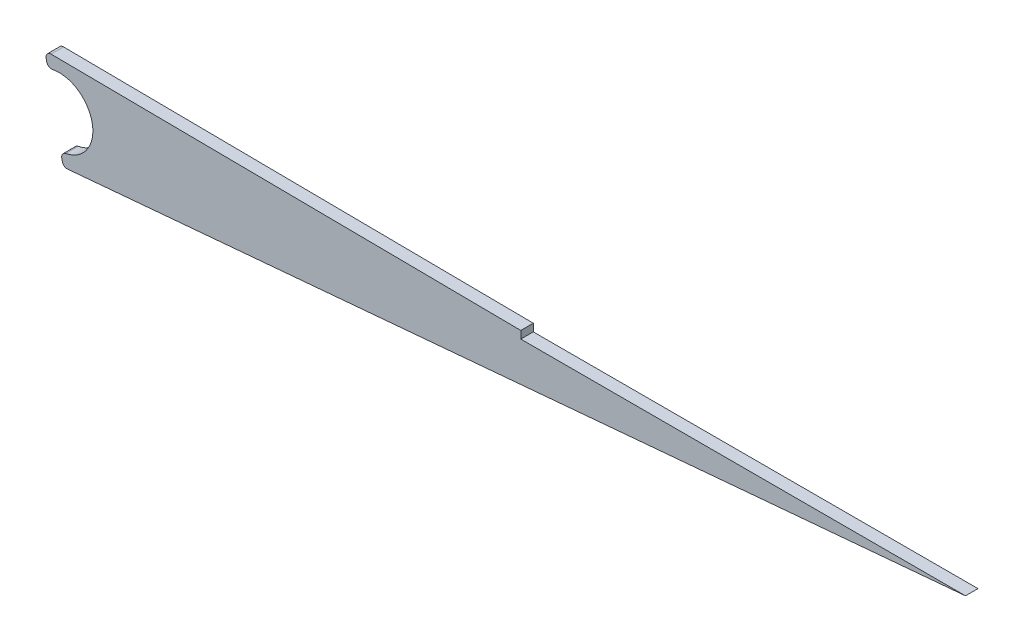
ISO-10303-21;
HEADER;
FILE_DESCRIPTION(('STEP AP214'),'2;1');
FILE_NAME('part.step','',(''),(''),'','','');
FILE_SCHEMA(('AUTOMOTIVE_DESIGN { 1 0 10303 214 1 1 1 1 }'));
ENDSEC;
DATA;
#1=APPLICATION_CONTEXT('core data for automotive mechanical design processes');
#2=APPLICATION_PROTOCOL_DEFINITION('international standard','automotive_design',2000,#1);
#3=PRODUCT_CONTEXT('',#1,'mechanical');
#4=PRODUCT('Part','Part','',(#3));
#5=PRODUCT_RELATED_PRODUCT_CATEGORY('part','',(#4));
#6=PRODUCT_DEFINITION_FORMATION('','',#4);
#7=PRODUCT_DEFINITION_CONTEXT('part definition',#1,'design');
#8=PRODUCT_DEFINITION('design','',#6,#7);
#9=PRODUCT_DEFINITION_SHAPE('','',#8);
#10=(LENGTH_UNIT() NAMED_UNIT(*) SI_UNIT(.MILLI.,.METRE.));
#11=(NAMED_UNIT(*) PLANE_ANGLE_UNIT() SI_UNIT($,.RADIAN.));
#12=(NAMED_UNIT(*) SI_UNIT($,.STERADIAN.) SOLID_ANGLE_UNIT());
#13=UNCERTAINTY_MEASURE_WITH_UNIT(LENGTH_MEASURE(1.E-05),#10,'distance_accuracy_value','');
#14=(GEOMETRIC_REPRESENTATION_CONTEXT(3) GLOBAL_UNCERTAINTY_ASSIGNED_CONTEXT((#13)) GLOBAL_UNIT_ASSIGNED_CONTEXT((#10,
#11,#12)) REPRESENTATION_CONTEXT('',''));
#15=CARTESIAN_POINT('',(0.,0.,0.));
#16=DIRECTION('',(0.,0.,1.));
#17=DIRECTION('',(1.,0.,0.));
#18=AXIS2_PLACEMENT_3D('',#15,#16,#17);
#19=CARTESIAN_POINT('',(-1.6306400674182E-13,-16.4999999999999,-5.));
#20=DIRECTION('',(0.,0.,1.));
#21=DIRECTION('',(1.,0.,0.));
#22=AXIS2_PLACEMENT_3D('',#19,#20,#21);
#23=CYLINDRICAL_SURFACE('',#22,13.5);
#24=CARTESIAN_POINT('',(-1.6306400674182E-13,-16.4999999999999,0.));
#25=DIRECTION('',(0.,0.,-1.));
#26=DIRECTION('',(1.,0.,0.));
#27=AXIS2_PLACEMENT_3D('',#24,#25,#26);
#28=CIRCLE('',#27,13.5);
#29=CARTESIAN_POINT('',(-2.64458290511463,-3.26156424429309,0.));
#30=VERTEX_POINT('',#29);
#31=CARTESIAN_POINT('',(2.63555033363898,-29.7402369479875,0.));
#32=VERTEX_POINT('',#31);
#33=EDGE_CURVE('E149',#30,#32,#28,.T.);
#34=ORIENTED_EDGE('',*,*,#33,.F.);
#35=DIRECTION('',(0.,0.,1.));
#36=VECTOR('',#35,1.);
#37=CARTESIAN_POINT('',(-2.64458290511463,-3.2615642442931,-5.));
#38=LINE('',#37,#36);
#39=CARTESIAN_POINT('',(-2.64458290511463,-3.2615642442931,-5.));
#40=VERTEX_POINT('',#39);
#41=EDGE_CURVE('E11',#40,#30,#38,.T.);
#42=ORIENTED_EDGE('',*,*,#41,.F.);
#43=CARTESIAN_POINT('',(-1.6306400674182E-13,-16.4999999999999,-5.));
#44=DIRECTION('',(0.,0.,-1.));
#45=DIRECTION('',(1.,0.,0.));
#46=AXIS2_PLACEMENT_3D('',#43,#44,#45);
#47=CIRCLE('',#46,13.5);
#48=CARTESIAN_POINT('',(2.63555033363898,-29.7402369479875,-5.));
#49=VERTEX_POINT('',#48);
#50=EDGE_CURVE('E178',#40,#49,#47,.T.);
#51=ORIENTED_EDGE('',*,*,#50,.T.);
#52=DIRECTION('',(0.,0.,1.));
#53=VECTOR('',#52,1.);
#54=CARTESIAN_POINT('',(2.63555033363898,-29.7402369479875,-5.));
#55=LINE('',#54,#53);
#56=EDGE_CURVE('E37',#49,#32,#55,.T.);
#57=ORIENTED_EDGE('',*,*,#56,.T.);
#58=EDGE_LOOP('',(#34,#42,#51,#57));
#59=FACE_BOUND('',#58,.T.);
#60=ADVANCED_FACE('F34',(#59),#23,.F.);
#61=CARTESIAN_POINT('',(-3.03637296513159,-1.3003145027069,-5.));
#62=DIRECTION('',(0.,0.,1.));
#63=DIRECTION('',(1.,0.,0.));
#64=AXIS2_PLACEMENT_3D('',#61,#62,#63);
#65=CYLINDRICAL_SURFACE('',#64,2.);
#66=CARTESIAN_POINT('',(-3.03637296513158,-1.30031450270689,0.));
#67=DIRECTION('',(0.,0.,1.));
#68=DIRECTION('',(1.,0.,0.));
#69=AXIS2_PLACEMENT_3D('',#66,#67,#68);
#70=CIRCLE('',#69,2.);
#71=CARTESIAN_POINT('',(-4.99775624248848,-1.69143550611213,0.));
#72=VERTEX_POINT('',#71);
#73=EDGE_CURVE('E176',#72,#30,#70,.T.);
#74=ORIENTED_EDGE('',*,*,#73,.F.);
#75=DIRECTION('',(0.,0.,1.));
#76=VECTOR('',#75,1.);
#77=CARTESIAN_POINT('',(-4.99775624248849,-1.69143550611213,-5.));
#78=LINE('',#77,#76);
#79=CARTESIAN_POINT('',(-4.99775624248849,-1.69143550611213,-5.));
#80=VERTEX_POINT('',#79);
#81=EDGE_CURVE('E43',#80,#72,#78,.T.);
#82=ORIENTED_EDGE('',*,*,#81,.F.);
#83=CARTESIAN_POINT('',(-3.03637296513159,-1.3003145027069,-5.));
#84=DIRECTION('',(0.,0.,1.));
#85=DIRECTION('',(1.,0.,0.));
#86=AXIS2_PLACEMENT_3D('',#83,#84,#85);
#87=CIRCLE('',#86,2.);
#88=EDGE_CURVE('E139',#80,#40,#87,.T.);
#89=ORIENTED_EDGE('',*,*,#88,.T.);
#90=ORIENTED_EDGE('',*,*,#41,.T.);
#91=EDGE_LOOP('',(#74,#82,#89,#90));
#92=FACE_BOUND('',#91,.T.);
#93=ADVANCED_FACE('F196',(#92),#65,.T.);
#94=CARTESIAN_POINT('',(-4.99775624248849,-1.69143550611213,-5.));
#95=DIRECTION('',(-0.98069163867845,-0.195560501702618,0.));
#96=DIRECTION('',(0.195560501702618,-0.98069163867845,0.));
#97=AXIS2_PLACEMENT_3D('',#94,#95,#96);
#98=PLANE('',#97);
#99=DIRECTION('',(0.195560501702618,-0.98069163867845,0.));
#100=VECTOR('',#99,1.);
#101=CARTESIAN_POINT('',(-4.99775624248848,-1.69143550611213,0.));
#102=LINE('',#101,#100);
#103=CARTESIAN_POINT('',(-5.21232878760464,-0.615402774280877,0.));
#104=VERTEX_POINT('',#103);
#105=EDGE_CURVE('E126',#104,#72,#102,.T.);
#106=ORIENTED_EDGE('',*,*,#105,.F.);
#107=DIRECTION('',(0.,0.,1.));
#108=VECTOR('',#107,1.);
#109=CARTESIAN_POINT('',(-5.21232878760464,-0.61540277428088,-5.));
#110=LINE('',#109,#108);
#111=CARTESIAN_POINT('',(-5.21232878760464,-0.61540277428088,-5.));
#112=VERTEX_POINT('',#111);
#113=EDGE_CURVE('E121',#112,#104,#110,.T.);
#114=ORIENTED_EDGE('',*,*,#113,.F.);
#115=DIRECTION('',(0.195560501702618,-0.98069163867845,0.));
#116=VECTOR('',#115,1.);
#117=CARTESIAN_POINT('',(-4.99775624248849,-1.69143550611213,-5.));
#118=LINE('',#117,#116);
#119=EDGE_CURVE('E124',#112,#80,#118,.T.);
#120=ORIENTED_EDGE('',*,*,#119,.T.);
#121=ORIENTED_EDGE('',*,*,#81,.T.);
#122=EDGE_LOOP('',(#106,#114,#120,#121));
#123=FACE_BOUND('',#122,.T.);
#124=ADVANCED_FACE('F123',(#123),#98,.T.);
#125=CARTESIAN_POINT('',(-3.25094551024773,-0.224281770875658,-5.));
#126=DIRECTION('',(0.,0.,1.));
#127=DIRECTION('',(1.,0.,0.));
#128=AXIS2_PLACEMENT_3D('',#125,#126,#127);
#129=CYLINDRICAL_SURFACE('',#128,2.);
#130=CARTESIAN_POINT('',(-3.25094551024773,-0.224281770875648,0.));
#131=DIRECTION('',(0.,0.,1.));
#132=DIRECTION('',(1.,0.,0.));
#133=AXIS2_PLACEMENT_3D('',#130,#131,#132);
#134=CIRCLE('',#133,2.);
#135=CARTESIAN_POINT('',(-3.23204844817642,1.77562895239304,0.));
#136=VERTEX_POINT('',#135);
#137=EDGE_CURVE('E173',#136,#104,#134,.T.);
#138=ORIENTED_EDGE('',*,*,#137,.F.);
#139=DIRECTION('',(0.,0.,1.));
#140=VECTOR('',#139,1.);
#141=CARTESIAN_POINT('',(-3.23204844817642,1.77562895239304,-5.));
#142=LINE('',#141,#140);
#143=CARTESIAN_POINT('',(-3.23204844817642,1.77562895239304,-5.));
#144=VERTEX_POINT('',#143);
#145=EDGE_CURVE('E131',#144,#136,#142,.T.);
#146=ORIENTED_EDGE('',*,*,#145,.F.);
#147=CARTESIAN_POINT('',(-3.25094551024773,-0.224281770875658,-5.));
#148=DIRECTION('',(0.,0.,1.));
#149=DIRECTION('',(1.,0.,0.));
#150=AXIS2_PLACEMENT_3D('',#147,#148,#149);
#151=CIRCLE('',#150,2.);
#152=EDGE_CURVE('E137',#144,#112,#151,.T.);
#153=ORIENTED_EDGE('',*,*,#152,.T.);
#154=ORIENTED_EDGE('',*,*,#113,.T.);
#155=EDGE_LOOP('',(#138,#146,#153,#154));
#156=FACE_BOUND('',#155,.T.);
#157=ADVANCED_FACE('F141',(#156),#129,.T.);
#158=CARTESIAN_POINT('',(184.686018870296,0.,-5.));
#159=DIRECTION('',(0.00944853103565357,0.999955361634344,0.));
#160=DIRECTION('',(-0.999955361634344,0.00944853103565357,0.));
#161=AXIS2_PLACEMENT_3D('',#158,#159,#160);
#162=PLANE('',#161);
#163=DIRECTION('',(-0.999955361634344,0.00944853103565357,0.));
#164=VECTOR('',#163,1.);
#165=CARTESIAN_POINT('',(184.686018870296,0.,0.));
#166=LINE('',#165,#164);
#167=CARTESIAN_POINT('',(184.686018870296,0.,0.));
#168=VERTEX_POINT('',#167);
#169=EDGE_CURVE('E170',#168,#136,#166,.T.);
#170=ORIENTED_EDGE('',*,*,#169,.F.);
#171=DIRECTION('',(0.,0.,1.));
#172=VECTOR('',#171,1.);
#173=CARTESIAN_POINT('',(184.686018870296,0.,-5.));
#174=LINE('',#173,#172);
#175=CARTESIAN_POINT('',(184.686018870296,0.,-5.));
#176=VERTEX_POINT('',#175);
#177=EDGE_CURVE('E182',#176,#168,#174,.T.);
#178=ORIENTED_EDGE('',*,*,#177,.F.);
#179=DIRECTION('',(-0.999955361634344,0.00944853103565357,0.));
#180=VECTOR('',#179,1.);
#181=CARTESIAN_POINT('',(184.686018870296,0.,-5.));
#182=LINE('',#181,#180);
#183=EDGE_CURVE('E142',#176,#144,#182,.T.);
#184=ORIENTED_EDGE('',*,*,#183,.T.);
#185=ORIENTED_EDGE('',*,*,#145,.T.);
#186=EDGE_LOOP('',(#170,#178,#184,#185));
#187=FACE_BOUND('',#186,.T.);
#188=ADVANCED_FACE('F209',(#187),#162,.T.);
#189=CARTESIAN_POINT('',(184.686018870296,0.,-5.));
#190=DIRECTION('',(1.,0.,0.));
#191=DIRECTION('',(0.,0.,-1.));
#192=AXIS2_PLACEMENT_3D('',#189,#190,#191);
#193=PLANE('',#192);
#194=DIRECTION('',(0.,1.,0.));
#195=VECTOR('',#194,1.);
#196=CARTESIAN_POINT('',(184.686018870296,0.,0.));
#197=LINE('',#196,#195);
#198=CARTESIAN_POINT('',(184.686018870296,-2.99999999999998,0.));
#199=VERTEX_POINT('',#198);
#200=EDGE_CURVE('E167',#199,#168,#197,.T.);
#201=ORIENTED_EDGE('',*,*,#200,.F.);
#202=DIRECTION('',(0.,0.,1.));
#203=VECTOR('',#202,1.);
#204=CARTESIAN_POINT('',(184.686018870296,-3.00000000000001,-4.99999999999998));
#205=LINE('',#204,#203);
#206=CARTESIAN_POINT('',(184.686018870296,-3.00000000000001,-4.99999999999998));
#207=VERTEX_POINT('',#206);
#208=EDGE_CURVE('E184',#207,#199,#205,.T.);
#209=ORIENTED_EDGE('',*,*,#208,.F.);
#210=DIRECTION('',(0.,1.,0.));
#211=VECTOR('',#210,1.);
#212=CARTESIAN_POINT('',(184.686018870296,0.,-5.));
#213=LINE('',#212,#211);
#214=EDGE_CURVE('E144',#207,#176,#213,.T.);
#215=ORIENTED_EDGE('',*,*,#214,.T.);
#216=ORIENTED_EDGE('',*,*,#177,.T.);
#217=EDGE_LOOP('',(#201,#209,#215,#216));
#218=FACE_BOUND('',#217,.T.);
#219=ADVANCED_FACE('F212',(#218),#193,.T.);
#220=CARTESIAN_POINT('',(362.597814819386,-3.00000000000003,-5.));
#221=DIRECTION('',(0.,1.,0.));
#222=DIRECTION('',(-1.,0.,0.));
#223=AXIS2_PLACEMENT_3D('',#220,#221,#222);
#224=PLANE('',#223);
#225=DIRECTION('',(-1.,0.,0.));
#226=VECTOR('',#225,1.);
#227=CARTESIAN_POINT('',(362.597814819386,-3.00000000000003,0.));
#228=LINE('',#227,#226);
#229=CARTESIAN_POINT('',(362.597814819386,-3.00000000000003,0.));
#230=VERTEX_POINT('',#229);
#231=EDGE_CURVE('E164',#230,#199,#228,.T.);
#232=ORIENTED_EDGE('',*,*,#231,.F.);
#233=DIRECTION('',(0.,0.,1.));
#234=VECTOR('',#233,1.);
#235=CARTESIAN_POINT('',(362.597814819386,-3.00000000000003,-5.));
#236=LINE('',#235,#234);
#237=CARTESIAN_POINT('',(362.597814819386,-3.00000000000003,-5.));
#238=VERTEX_POINT('',#237);
#239=EDGE_CURVE('E186',#238,#230,#236,.T.);
#240=ORIENTED_EDGE('',*,*,#239,.F.);
#241=DIRECTION('',(-1.,0.,0.));
#242=VECTOR('',#241,1.);
#243=CARTESIAN_POINT('',(362.597814819386,-3.00000000000003,-5.));
#244=LINE('',#243,#242);
#245=EDGE_CURVE('E328',#238,#207,#244,.T.);
#246=ORIENTED_EDGE('',*,*,#245,.T.);
#247=ORIENTED_EDGE('',*,*,#208,.T.);
#248=EDGE_LOOP('',(#232,#240,#246,#247));
#249=FACE_BOUND('',#248,.T.);
#250=ADVANCED_FACE('F216',(#249),#224,.T.);
#251=CARTESIAN_POINT('',(362.597814819386,-3.00000000000003,-5.));
#252=DIRECTION('',(0.0881072557728994,-0.996110993554519,0.));
#253=DIRECTION('',(0.99611099355452,0.0881072557728994,0.));
#254=AXIS2_PLACEMENT_3D('',#251,#252,#253);
#255=PLANE('',#254);
#256=DIRECTION('',(0.996110993554519,0.0881072557728994,0.));
#257=VECTOR('',#256,1.);
#258=CARTESIAN_POINT('',(362.597814819386,-3.00000000000003,0.));
#259=LINE('',#258,#257);
#260=CARTESIAN_POINT('',(3.41678929158082,-34.7700082518149,0.));
#261=VERTEX_POINT('',#260);
#262=EDGE_CURVE('E161',#261,#230,#259,.T.);
#263=ORIENTED_EDGE('',*,*,#262,.F.);
#264=DIRECTION('',(0.,0.,1.));
#265=VECTOR('',#264,1.);
#266=CARTESIAN_POINT('',(3.41678929158082,-34.7700082518149,-5.));
#267=LINE('',#266,#265);
#268=CARTESIAN_POINT('',(3.41678929158082,-34.7700082518149,-5.));
#269=VERTEX_POINT('',#268);
#270=EDGE_CURVE('E188',#269,#261,#267,.T.);
#271=ORIENTED_EDGE('',*,*,#270,.F.);
#272=DIRECTION('',(0.996110993554519,0.0881072557728994,0.));
#273=VECTOR('',#272,1.);
#274=CARTESIAN_POINT('',(362.597814819386,-3.00000000000003,-5.));
#275=LINE('',#274,#273);
#276=EDGE_CURVE('E321',#269,#238,#275,.T.);
#277=ORIENTED_EDGE('',*,*,#276,.T.);
#278=ORIENTED_EDGE('',*,*,#239,.T.);
#279=EDGE_LOOP('',(#263,#271,#277,#278));
#280=FACE_BOUND('',#279,.T.);
#281=ADVANCED_FACE('F220',(#280),#255,.T.);
#282=CARTESIAN_POINT('',(3.24057478003501,-32.7777862647059,-5.));
#283=DIRECTION('',(0.,0.,1.));
#284=DIRECTION('',(1.,0.,0.));
#285=AXIS2_PLACEMENT_3D('',#282,#283,#284);
#286=CYLINDRICAL_SURFACE('',#285,2.);
#287=CARTESIAN_POINT('',(3.24057478003501,-32.7777862647059,0.));
#288=DIRECTION('',(0.,0.,1.));
#289=DIRECTION('',(1.,0.,0.));
#290=AXIS2_PLACEMENT_3D('',#287,#288,#289);
#291=CIRCLE('',#290,2.);
#292=CARTESIAN_POINT('',(1.27919150267811,-33.1689072681111,0.));
#293=VERTEX_POINT('',#292);
#294=EDGE_CURVE('E158',#293,#261,#291,.T.);
#295=ORIENTED_EDGE('',*,*,#294,.F.);
#296=DIRECTION('',(0.,0.,1.));
#297=VECTOR('',#296,1.);
#298=CARTESIAN_POINT('',(1.27919150267811,-33.1689072681111,-5.));
#299=LINE('',#298,#297);
#300=CARTESIAN_POINT('',(1.27919150267811,-33.1689072681111,-5.));
#301=VERTEX_POINT('',#300);
#302=EDGE_CURVE('E190',#301,#293,#299,.T.);
#303=ORIENTED_EDGE('',*,*,#302,.F.);
#304=CARTESIAN_POINT('',(3.24057478003501,-32.7777862647059,-5.));
#305=DIRECTION('',(0.,0.,1.));
#306=DIRECTION('',(1.,0.,0.));
#307=AXIS2_PLACEMENT_3D('',#304,#305,#306);
#308=CIRCLE('',#307,2.);
#309=EDGE_CURVE('E317',#301,#269,#308,.T.);
#310=ORIENTED_EDGE('',*,*,#309,.T.);
#311=ORIENTED_EDGE('',*,*,#270,.T.);
#312=EDGE_LOOP('',(#295,#303,#310,#311));
#313=FACE_BOUND('',#312,.T.);
#314=ADVANCED_FACE('F224',(#313),#286,.T.);
#315=CARTESIAN_POINT('',(1.27919150267811,-33.1689072681111,-5.));
#316=DIRECTION('',(-0.98069163867845,-0.195560501702618,0.));
#317=DIRECTION('',(0.195560501702618,-0.98069163867845,0.));
#318=AXIS2_PLACEMENT_3D('',#315,#316,#317);
#319=PLANE('',#318);
#320=DIRECTION('',(0.195560501702618,-0.98069163867845,0.));
#321=VECTOR('',#320,1.);
#322=CARTESIAN_POINT('',(1.27919150267811,-33.1689072681111,0.));
#323=LINE('',#322,#321);
#324=CARTESIAN_POINT('',(1.06461895756194,-32.0928745362798,0.));
#325=VERTEX_POINT('',#324);
#326=EDGE_CURVE('E155',#325,#293,#323,.T.);
#327=ORIENTED_EDGE('',*,*,#326,.F.);
#328=DIRECTION('',(0.,0.,1.));
#329=VECTOR('',#328,1.);
#330=CARTESIAN_POINT('',(1.06461895756194,-32.0928745362798,-5.));
#331=LINE('',#330,#329);
#332=CARTESIAN_POINT('',(1.06461895756194,-32.0928745362798,-5.));
#333=VERTEX_POINT('',#332);
#334=EDGE_CURVE('E191',#333,#325,#331,.T.);
#335=ORIENTED_EDGE('',*,*,#334,.F.);
#336=DIRECTION('',(0.195560501702618,-0.98069163867845,0.));
#337=VECTOR('',#336,1.);
#338=CARTESIAN_POINT('',(1.27919150267811,-33.1689072681111,-5.));
#339=LINE('',#338,#337);
#340=EDGE_CURVE('E333',#333,#301,#339,.T.);
#341=ORIENTED_EDGE('',*,*,#340,.T.);
#342=ORIENTED_EDGE('',*,*,#302,.T.);
#343=EDGE_LOOP('',(#327,#335,#341,#342));
#344=FACE_BOUND('',#343,.T.);
#345=ADVANCED_FACE('F228',(#344),#319,.T.);
#346=CARTESIAN_POINT('',(3.02600223491886,-31.7017535328746,-5.));
#347=DIRECTION('',(0.,0.,1.));
#348=DIRECTION('',(1.,0.,0.));
#349=AXIS2_PLACEMENT_3D('',#346,#347,#348);
#350=CYLINDRICAL_SURFACE('',#349,2.);
#351=CARTESIAN_POINT('',(3.02600223491886,-31.7017535328745,0.));
#352=DIRECTION('',(0.,0.,1.));
#353=DIRECTION('',(1.,0.,0.));
#354=AXIS2_PLACEMENT_3D('',#351,#352,#353);
#355=CIRCLE('',#354,2.);
#356=EDGE_CURVE('E152',#32,#325,#355,.T.);
#357=ORIENTED_EDGE('',*,*,#356,.F.);
#358=ORIENTED_EDGE('',*,*,#56,.F.);
#359=CARTESIAN_POINT('',(3.02600223491886,-31.7017535328746,-5.));
#360=DIRECTION('',(0.,0.,1.));
#361=DIRECTION('',(1.,0.,0.));
#362=AXIS2_PLACEMENT_3D('',#359,#360,#361);
#363=CIRCLE('',#362,2.);
#364=EDGE_CURVE('E335',#49,#333,#363,.T.);
#365=ORIENTED_EDGE('',*,*,#364,.T.);
#366=ORIENTED_EDGE('',*,*,#334,.T.);
#367=EDGE_LOOP('',(#357,#358,#365,#366));
#368=FACE_BOUND('',#367,.T.);
#369=ADVANCED_FACE('F193',(#368),#350,.T.);
#370=CARTESIAN_POINT('',(-1.6306400674182E-13,-16.4999999999999,-5.));
#371=DIRECTION('',(0.,0.,1.));
#372=DIRECTION('',(1.,0.,0.));
#373=AXIS2_PLACEMENT_3D('',#370,#371,#372);
#374=PLANE('',#373);
#375=ORIENTED_EDGE('',*,*,#50,.F.);
#376=ORIENTED_EDGE('',*,*,#88,.F.);
#377=ORIENTED_EDGE('',*,*,#119,.F.);
#378=ORIENTED_EDGE('',*,*,#152,.F.);
#379=ORIENTED_EDGE('',*,*,#183,.F.);
#380=ORIENTED_EDGE('',*,*,#214,.F.);
#381=ORIENTED_EDGE('',*,*,#245,.F.);
#382=ORIENTED_EDGE('',*,*,#276,.F.);
#383=ORIENTED_EDGE('',*,*,#309,.F.);
#384=ORIENTED_EDGE('',*,*,#340,.F.);
#385=ORIENTED_EDGE('',*,*,#364,.F.);
#386=EDGE_LOOP('',(#375,#376,#377,#378,#379,#380,#381,#382,#383,#384,#385));
#387=FACE_BOUND('',#386,.T.);
#388=ADVANCED_FACE('F135',(#387),#374,.F.);
#389=CARTESIAN_POINT('',(-1.6306400674182E-13,-16.4999999999999,0.));
#390=DIRECTION('',(0.,0.,1.));
#391=DIRECTION('',(1.,0.,0.));
#392=AXIS2_PLACEMENT_3D('',#389,#390,#391);
#393=PLANE('',#392);
#394=ORIENTED_EDGE('',*,*,#33,.T.);
#395=ORIENTED_EDGE('',*,*,#356,.T.);
#396=ORIENTED_EDGE('',*,*,#326,.T.);
#397=ORIENTED_EDGE('',*,*,#294,.T.);
#398=ORIENTED_EDGE('',*,*,#262,.T.);
#399=ORIENTED_EDGE('',*,*,#231,.T.);
#400=ORIENTED_EDGE('',*,*,#200,.T.);
#401=ORIENTED_EDGE('',*,*,#169,.T.);
#402=ORIENTED_EDGE('',*,*,#137,.T.);
#403=ORIENTED_EDGE('',*,*,#105,.T.);
#404=ORIENTED_EDGE('',*,*,#73,.T.);
#405=EDGE_LOOP('',(#394,#395,#396,#397,#398,#399,#400,#401,#402,#403,#404));
#406=FACE_BOUND('',#405,.T.);
#407=ADVANCED_FACE('F195',(#406),#393,.T.);
#408=CLOSED_SHELL('',(#60,#93,#124,#157,#188,#219,#250,#281,#314,#345,#369,#388,#407));
#409=MANIFOLD_SOLID_BREP('B2',#408);
#410=ADVANCED_BREP_SHAPE_REPRESENTATION('',(#18,#409),#14);
#411=SHAPE_DEFINITION_REPRESENTATION(#9,#410);
ENDSEC;
END-ISO-10303-21;
